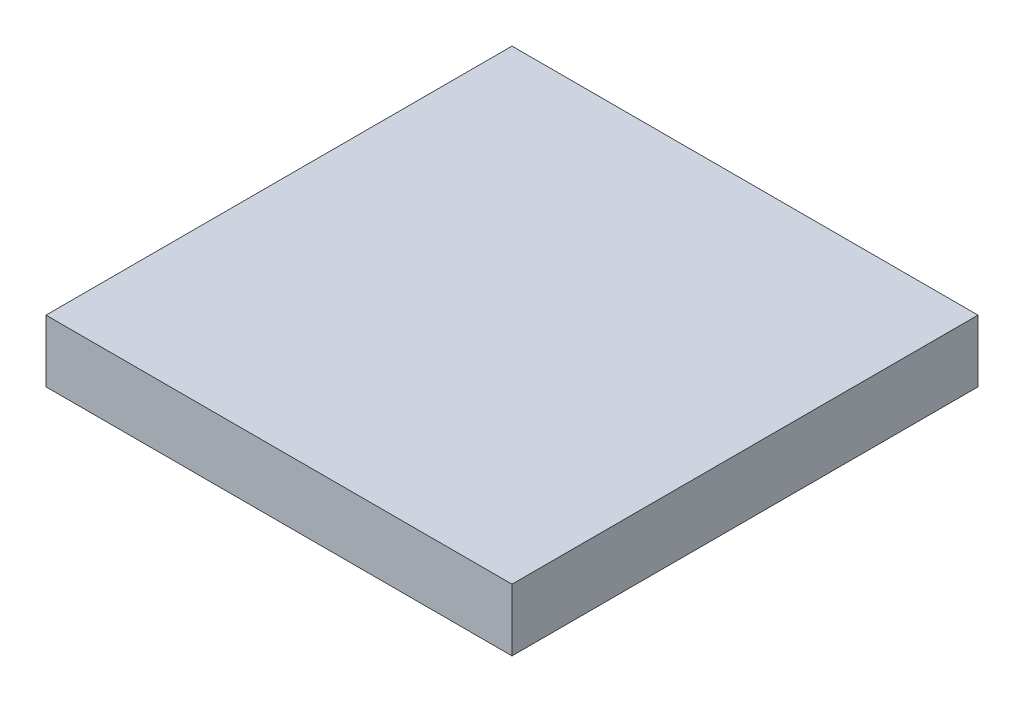
ISO-10303-21;
HEADER;
FILE_DESCRIPTION(('STEP AP214'),'2;1');
FILE_NAME('part.step','',(''),(''),'','','');
FILE_SCHEMA(('AUTOMOTIVE_DESIGN { 1 0 10303 214 1 1 1 1 }'));
ENDSEC;
DATA;
#1=APPLICATION_CONTEXT('core data for automotive mechanical design processes');
#2=APPLICATION_PROTOCOL_DEFINITION('international standard','automotive_design',2000,#1);
#3=PRODUCT_CONTEXT('',#1,'mechanical');
#4=PRODUCT('Part','Part','',(#3));
#5=PRODUCT_RELATED_PRODUCT_CATEGORY('part','',(#4));
#6=PRODUCT_DEFINITION_FORMATION('','',#4);
#7=PRODUCT_DEFINITION_CONTEXT('part definition',#1,'design');
#8=PRODUCT_DEFINITION('design','',#6,#7);
#9=PRODUCT_DEFINITION_SHAPE('','',#8);
#10=(LENGTH_UNIT() NAMED_UNIT(*) SI_UNIT(.MILLI.,.METRE.));
#11=(NAMED_UNIT(*) PLANE_ANGLE_UNIT() SI_UNIT($,.RADIAN.));
#12=(NAMED_UNIT(*) SI_UNIT($,.STERADIAN.) SOLID_ANGLE_UNIT());
#13=UNCERTAINTY_MEASURE_WITH_UNIT(LENGTH_MEASURE(1.E-05),#10,'distance_accuracy_value','');
#14=(GEOMETRIC_REPRESENTATION_CONTEXT(3) GLOBAL_UNCERTAINTY_ASSIGNED_CONTEXT((#13)) GLOBAL_UNIT_ASSIGNED_CONTEXT((#10,
#11,#12)) REPRESENTATION_CONTEXT('',''));
#15=CARTESIAN_POINT('',(0.,0.,0.));
#16=DIRECTION('',(0.,0.,1.));
#17=DIRECTION('',(1.,0.,0.));
#18=AXIS2_PLACEMENT_3D('',#15,#16,#17);
#19=CARTESIAN_POINT('',(-128.965517241379,40.,-82.7586206896552));
#20=DIRECTION('',(1.,0.,0.));
#21=DIRECTION('',(0.,0.,-1.));
#22=AXIS2_PLACEMENT_3D('',#19,#20,#21);
#23=PLANE('',#22);
#24=DIRECTION('',(0.,0.,1.));
#25=VECTOR('',#24,1.);
#26=CARTESIAN_POINT('',(-128.965517241379,0.,-82.7586206896552));
#27=LINE('',#26,#25);
#28=CARTESIAN_POINT('',(-128.965517241379,0.,-82.7586206896552));
#29=VERTEX_POINT('',#28);
#30=CARTESIAN_POINT('',(-128.965517241379,0.,217.241379310345));
#31=VERTEX_POINT('',#30);
#32=EDGE_CURVE('E107',#29,#31,#27,.T.);
#33=ORIENTED_EDGE('',*,*,#32,.T.);
#34=DIRECTION('',(0.,-1.,0.));
#35=VECTOR('',#34,1.);
#36=CARTESIAN_POINT('',(-128.965517241379,40.,217.241379310345));
#37=LINE('',#36,#35);
#38=CARTESIAN_POINT('',(-128.965517241379,40.,217.241379310345));
#39=VERTEX_POINT('',#38);
#40=EDGE_CURVE('E11',#39,#31,#37,.T.);
#41=ORIENTED_EDGE('',*,*,#40,.F.);
#42=DIRECTION('',(0.,0.,1.));
#43=VECTOR('',#42,1.);
#44=CARTESIAN_POINT('',(-128.965517241379,40.,-82.7586206896552));
#45=LINE('',#44,#43);
#46=CARTESIAN_POINT('',(-128.965517241379,40.,-82.7586206896552));
#47=VERTEX_POINT('',#46);
#48=EDGE_CURVE('E91',#47,#39,#45,.T.);
#49=ORIENTED_EDGE('',*,*,#48,.F.);
#50=DIRECTION('',(0.,-1.,0.));
#51=VECTOR('',#50,1.);
#52=CARTESIAN_POINT('',(-128.965517241379,40.,-82.7586206896552));
#53=LINE('',#52,#51);
#54=EDGE_CURVE('E103',#47,#29,#53,.T.);
#55=ORIENTED_EDGE('',*,*,#54,.T.);
#56=EDGE_LOOP('',(#33,#41,#49,#55));
#57=FACE_BOUND('',#56,.T.);
#58=ADVANCED_FACE('F39',(#57),#23,.F.);
#59=CARTESIAN_POINT('',(-128.965517241379,40.,217.241379310345));
#60=DIRECTION('',(0.,0.,-1.));
#61=DIRECTION('',(-1.,0.,0.));
#62=AXIS2_PLACEMENT_3D('',#59,#60,#61);
#63=PLANE('',#62);
#64=DIRECTION('',(1.,0.,0.));
#65=VECTOR('',#64,1.);
#66=CARTESIAN_POINT('',(-128.965517241379,0.,217.241379310345));
#67=LINE('',#66,#65);
#68=CARTESIAN_POINT('',(171.034482758621,0.,217.241379310345));
#69=VERTEX_POINT('',#68);
#70=EDGE_CURVE('E96',#31,#69,#67,.T.);
#71=ORIENTED_EDGE('',*,*,#70,.T.);
#72=DIRECTION('',(0.,-1.,0.));
#73=VECTOR('',#72,1.);
#74=CARTESIAN_POINT('',(171.034482758621,40.,217.241379310345));
#75=LINE('',#74,#73);
#76=CARTESIAN_POINT('',(171.034482758621,40.,217.241379310345));
#77=VERTEX_POINT('',#76);
#78=EDGE_CURVE('E48',#77,#69,#75,.T.);
#79=ORIENTED_EDGE('',*,*,#78,.F.);
#80=DIRECTION('',(1.,0.,0.));
#81=VECTOR('',#80,1.);
#82=CARTESIAN_POINT('',(-128.965517241379,40.,217.241379310345));
#83=LINE('',#82,#81);
#84=EDGE_CURVE('E86',#39,#77,#83,.T.);
#85=ORIENTED_EDGE('',*,*,#84,.F.);
#86=ORIENTED_EDGE('',*,*,#40,.T.);
#87=EDGE_LOOP('',(#71,#79,#85,#86));
#88=FACE_BOUND('',#87,.T.);
#89=ADVANCED_FACE('F95',(#88),#63,.F.);
#90=CARTESIAN_POINT('',(171.034482758621,40.,-82.7586206896552));
#91=DIRECTION('',(-1.,0.,0.));
#92=DIRECTION('',(0.,0.,1.));
#93=AXIS2_PLACEMENT_3D('',#90,#91,#92);
#94=PLANE('',#93);
#95=DIRECTION('',(0.,0.,-1.));
#96=VECTOR('',#95,1.);
#97=CARTESIAN_POINT('',(171.034482758621,0.,-82.7586206896552));
#98=LINE('',#97,#96);
#99=CARTESIAN_POINT('',(171.034482758621,0.,-82.7586206896552));
#100=VERTEX_POINT('',#99);
#101=EDGE_CURVE('E73',#69,#100,#98,.T.);
#102=ORIENTED_EDGE('',*,*,#101,.T.);
#103=DIRECTION('',(0.,-1.,0.));
#104=VECTOR('',#103,1.);
#105=CARTESIAN_POINT('',(171.034482758621,40.,-82.7586206896552));
#106=LINE('',#105,#104);
#107=CARTESIAN_POINT('',(171.034482758621,40.,-82.7586206896552));
#108=VERTEX_POINT('',#107);
#109=EDGE_CURVE('E98',#108,#100,#106,.T.);
#110=ORIENTED_EDGE('',*,*,#109,.F.);
#111=DIRECTION('',(0.,0.,-1.));
#112=VECTOR('',#111,1.);
#113=CARTESIAN_POINT('',(171.034482758621,40.,-82.7586206896552));
#114=LINE('',#113,#112);
#115=EDGE_CURVE('E89',#77,#108,#114,.T.);
#116=ORIENTED_EDGE('',*,*,#115,.F.);
#117=ORIENTED_EDGE('',*,*,#78,.T.);
#118=EDGE_LOOP('',(#102,#110,#116,#117));
#119=FACE_BOUND('',#118,.T.);
#120=ADVANCED_FACE('F99',(#119),#94,.F.);
#121=CARTESIAN_POINT('',(-128.965517241379,40.,-82.7586206896552));
#122=DIRECTION('',(0.,0.,1.));
#123=DIRECTION('',(1.,0.,0.));
#124=AXIS2_PLACEMENT_3D('',#121,#122,#123);
#125=PLANE('',#124);
#126=DIRECTION('',(-1.,0.,0.));
#127=VECTOR('',#126,1.);
#128=CARTESIAN_POINT('',(-128.965517241379,0.,-82.7586206896552));
#129=LINE('',#128,#127);
#130=EDGE_CURVE('E79',#100,#29,#129,.T.);
#131=ORIENTED_EDGE('',*,*,#130,.T.);
#132=ORIENTED_EDGE('',*,*,#54,.F.);
#133=DIRECTION('',(-1.,0.,0.));
#134=VECTOR('',#133,1.);
#135=CARTESIAN_POINT('',(-128.965517241379,40.,-82.7586206896552));
#136=LINE('',#135,#134);
#137=EDGE_CURVE('E56',#108,#47,#136,.T.);
#138=ORIENTED_EDGE('',*,*,#137,.F.);
#139=ORIENTED_EDGE('',*,*,#109,.T.);
#140=EDGE_LOOP('',(#131,#132,#138,#139));
#141=FACE_BOUND('',#140,.T.);
#142=ADVANCED_FACE('F120',(#141),#125,.F.);
#143=CARTESIAN_POINT('',(0.,40.,0.));
#144=DIRECTION('',(0.,1.,0.));
#145=DIRECTION('',(0.,0.,1.));
#146=AXIS2_PLACEMENT_3D('',#143,#144,#145);
#147=PLANE('',#146);
#148=ORIENTED_EDGE('',*,*,#48,.T.);
#149=ORIENTED_EDGE('',*,*,#84,.T.);
#150=ORIENTED_EDGE('',*,*,#115,.T.);
#151=ORIENTED_EDGE('',*,*,#137,.T.);
#152=EDGE_LOOP('',(#148,#149,#150,#151));
#153=FACE_BOUND('',#152,.T.);
#154=ADVANCED_FACE('F87',(#153),#147,.T.);
#155=CARTESIAN_POINT('',(0.,0.,0.));
#156=DIRECTION('',(0.,1.,0.));
#157=DIRECTION('',(0.,0.,1.));
#158=AXIS2_PLACEMENT_3D('',#155,#156,#157);
#159=PLANE('',#158);
#160=ORIENTED_EDGE('',*,*,#32,.F.);
#161=ORIENTED_EDGE('',*,*,#130,.F.);
#162=ORIENTED_EDGE('',*,*,#101,.F.);
#163=ORIENTED_EDGE('',*,*,#70,.F.);
#164=EDGE_LOOP('',(#160,#161,#162,#163));
#165=FACE_BOUND('',#164,.T.);
#166=ADVANCED_FACE('F123',(#165),#159,.F.);
#167=CLOSED_SHELL('',(#58,#89,#120,#142,#154,#166));
#168=MANIFOLD_SOLID_BREP('B2',#167);
#169=ADVANCED_BREP_SHAPE_REPRESENTATION('',(#18,#168),#14);
#170=SHAPE_DEFINITION_REPRESENTATION(#9,#169);
ENDSEC;
END-ISO-10303-21;
